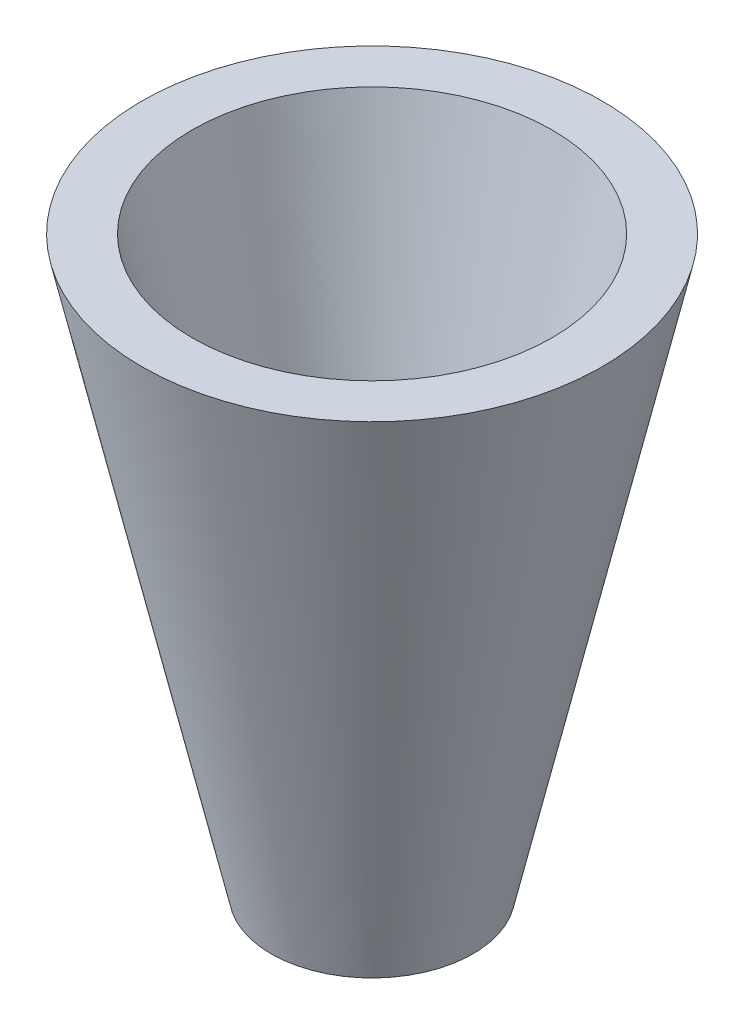
ISO-10303-21;
HEADER;
FILE_DESCRIPTION(('STEP AP214'),'2;1');
FILE_NAME('part.step','',(''),(''),'','','');
FILE_SCHEMA(('AUTOMOTIVE_DESIGN { 1 0 10303 214 1 1 1 1 }'));
ENDSEC;
DATA;
#1=APPLICATION_CONTEXT('core data for automotive mechanical design processes');
#2=APPLICATION_PROTOCOL_DEFINITION('international standard','automotive_design',2000,#1);
#3=PRODUCT_CONTEXT('',#1,'mechanical');
#4=PRODUCT('Part','Part','',(#3));
#5=PRODUCT_RELATED_PRODUCT_CATEGORY('part','',(#4));
#6=PRODUCT_DEFINITION_FORMATION('','',#4);
#7=PRODUCT_DEFINITION_CONTEXT('part definition',#1,'design');
#8=PRODUCT_DEFINITION('design','',#6,#7);
#9=PRODUCT_DEFINITION_SHAPE('','',#8);
#10=(LENGTH_UNIT() NAMED_UNIT(*) SI_UNIT(.MILLI.,.METRE.));
#11=(NAMED_UNIT(*) PLANE_ANGLE_UNIT() SI_UNIT($,.RADIAN.));
#12=(NAMED_UNIT(*) SI_UNIT($,.STERADIAN.) SOLID_ANGLE_UNIT());
#13=UNCERTAINTY_MEASURE_WITH_UNIT(LENGTH_MEASURE(1.E-05),#10,'distance_accuracy_value','');
#14=(GEOMETRIC_REPRESENTATION_CONTEXT(3) GLOBAL_UNCERTAINTY_ASSIGNED_CONTEXT((#13)) GLOBAL_UNIT_ASSIGNED_CONTEXT((#10,
#11,#12)) REPRESENTATION_CONTEXT('',''));
#15=CARTESIAN_POINT('',(0.,0.,0.));
#16=DIRECTION('',(0.,0.,1.));
#17=DIRECTION('',(1.,0.,0.));
#18=AXIS2_PLACEMENT_3D('',#15,#16,#17);
#19=CARTESIAN_POINT('',(47.0636635439506,55.4678891767989,0.));
#20=DIRECTION('',(0.,-1.,0.));
#21=DIRECTION('',(0.,0.,-1.));
#22=AXIS2_PLACEMENT_3D('',#19,#20,#21);
#23=PLANE('',#22);
#24=CARTESIAN_POINT('',(0.,55.4678891767989,0.));
#25=DIRECTION('',(0.,-1.,0.));
#26=DIRECTION('',(0.,0.,-1.));
#27=AXIS2_PLACEMENT_3D('',#24,#25,#26);
#28=CIRCLE('',#27,36.8127631240113);
#29=CARTESIAN_POINT('',(0.,55.4678891767989,36.8127631240113));
#30=VERTEX_POINT('',#29);
#31=EDGE_CURVE('E45',#30,#30,#28,.F.);
#32=ORIENTED_EDGE('',*,*,#31,.F.);
#33=EDGE_LOOP('',(#32));
#34=FACE_BOUND('',#33,.T.);
#35=CARTESIAN_POINT('',(0.,55.4678891767989,0.));
#36=DIRECTION('',(0.,1.,0.));
#37=DIRECTION('',(0.,0.,1.));
#38=AXIS2_PLACEMENT_3D('',#35,#36,#37);
#39=CIRCLE('',#38,47.0636635439506);
#40=CARTESIAN_POINT('',(0.,55.4678891767989,47.0636635439506));
#41=VERTEX_POINT('',#40);
#42=EDGE_CURVE('E37',#41,#41,#39,.T.);
#43=ORIENTED_EDGE('',*,*,#42,.T.);
#44=EDGE_LOOP('',(#43));
#45=FACE_BOUND('',#44,.T.);
#46=ADVANCED_FACE('F31',(#34,#45),#23,.F.);
#47=CARTESIAN_POINT('',(0.,-61.7110282183433,0.));
#48=DIRECTION('',(0.,1.,0.));
#49=DIRECTION('',(0.,0.,1.));
#50=AXIS2_PLACEMENT_3D('',#47,#48,#49);
#51=PLANE('',#50);
#52=CARTESIAN_POINT('',(0.,-61.7110282183433,0.));
#53=DIRECTION('',(0.,1.,0.));
#54=DIRECTION('',(0.,0.,1.));
#55=AXIS2_PLACEMENT_3D('',#52,#53,#54);
#56=CIRCLE('',#55,10.3994825636309);
#57=CARTESIAN_POINT('',(0.,-61.7110282183433,10.3994825636309));
#58=VERTEX_POINT('',#57);
#59=EDGE_CURVE('E41',#58,#58,#56,.T.);
#60=ORIENTED_EDGE('',*,*,#59,.T.);
#61=EDGE_LOOP('',(#60));
#62=FACE_BOUND('',#61,.T.);
#63=CARTESIAN_POINT('',(0.,-61.7110282183433,0.));
#64=DIRECTION('',(0.,1.,0.));
#65=DIRECTION('',(0.,0.,1.));
#66=AXIS2_PLACEMENT_3D('',#63,#64,#65);
#67=CIRCLE('',#66,20.6503829835701);
#68=CARTESIAN_POINT('',(0.,-61.7110282183433,20.6503829835701));
#69=VERTEX_POINT('',#68);
#70=EDGE_CURVE('E10',#69,#69,#67,.T.);
#71=ORIENTED_EDGE('',*,*,#70,.F.);
#72=EDGE_LOOP('',(#71));
#73=FACE_BOUND('',#72,.T.);
#74=ADVANCED_FACE('F55',(#62,#73),#51,.F.);
#75=CARTESIAN_POINT('',(0.,-61.7110282183433,0.));
#76=DIRECTION('',(0.,1.,0.));
#77=DIRECTION('',(0.,0.,1.));
#78=AXIS2_PLACEMENT_3D('',#75,#76,#77);
#79=CONICAL_SURFACE('',#78,20.6503829835701,0.221704495960385);
#80=ORIENTED_EDGE('',*,*,#42,.F.);
#81=EDGE_LOOP('',(#80));
#82=FACE_BOUND('',#81,.T.);
#83=ORIENTED_EDGE('',*,*,#70,.T.);
#84=EDGE_LOOP('',(#83));
#85=FACE_BOUND('',#84,.T.);
#86=ADVANCED_FACE('F59',(#82,#85),#79,.T.);
#87=CARTESIAN_POINT('',(0.,-59.5121010331068,0.));
#88=DIRECTION('',(0.,1.,0.));
#89=DIRECTION('',(0.,0.,1.));
#90=AXIS2_PLACEMENT_3D('',#87,#88,#89);
#91=CONICAL_SURFACE('',#90,10.8951423799752,0.221704495960385);
#92=CARTESIAN_POINT('',(0.,55.4678891767989,36.8127631240113));
#93=CARTESIAN_POINT('',(0.,54.2472754539328,36.5376247848407));
#94=CARTESIAN_POINT('',(0.,53.0266617310668,36.2624864456701));
#95=CARTESIAN_POINT('',(0.,50.5854342853346,35.7122097673288));
#96=CARTESIAN_POINT('',(0.,49.3648205624686,35.4370714281582));
#97=CARTESIAN_POINT('',(0.,46.9235931167364,34.8867947498169));
#98=CARTESIAN_POINT('',(0.,45.7029793938704,34.6116564106463));
#99=CARTESIAN_POINT('',(0.,43.2617519481382,34.061379732305));
#100=CARTESIAN_POINT('',(0.,42.0411382252722,33.7862413931344));
#101=CARTESIAN_POINT('',(0.,39.5999107795401,33.2359647147931));
#102=CARTESIAN_POINT('',(0.,38.379297056674,32.9608263756225));
#103=CARTESIAN_POINT('',(0.,35.9380696109419,32.4105496972812));
#104=CARTESIAN_POINT('',(0.,34.7174558880758,32.1354113581106));
#105=CARTESIAN_POINT('',(0.,32.2762284423437,31.5851346797694));
#106=CARTESIAN_POINT('',(0.,31.0556147194776,31.3099963405987));
#107=CARTESIAN_POINT('',(0.,28.6143872737455,30.7597196622575));
#108=CARTESIAN_POINT('',(0.,27.3937735508794,30.4845813230869));
#109=CARTESIAN_POINT('',(0.,24.9525461051473,29.9343046447456));
#110=CARTESIAN_POINT('',(0.,23.7319323822812,29.6591663055749));
#111=CARTESIAN_POINT('',(0.,21.2907049365491,29.1088896272337));
#112=CARTESIAN_POINT('',(0.,20.070091213683,28.8337512880631));
#113=CARTESIAN_POINT('',(0.,17.6288637679509,28.2834746097218));
#114=CARTESIAN_POINT('',(0.,16.4082500450848,28.0083362705512));
#115=CARTESIAN_POINT('',(0.,13.9670225993527,27.4580595922099));
#116=CARTESIAN_POINT('',(0.,12.7464088764866,27.1829212530393));
#117=CARTESIAN_POINT('',(0.,10.3051814307545,26.632644574698));
#118=CARTESIAN_POINT('',(0.,9.08456770788843,26.3575062355274));
#119=CARTESIAN_POINT('',(0.,6.6433402621563,25.8072295571861));
#120=CARTESIAN_POINT('',(0.,5.42272653929024,25.5320912180155));
#121=CARTESIAN_POINT('',(0.,2.98149909355811,24.9818145396742));
#122=CARTESIAN_POINT('',(0.,1.76088537069204,24.7066762005036));
#123=CARTESIAN_POINT('',(0.,-0.68034207504009,24.1563995221624));
#124=CARTESIAN_POINT('',(0.,-1.90095579790616,23.8812611829917));
#125=CARTESIAN_POINT('',(0.,-4.34218324363829,23.3309845046505));
#126=CARTESIAN_POINT('',(0.,-5.56279696650435,23.0558461654798));
#127=CARTESIAN_POINT('',(0.,-8.00402441223648,22.5055694871386));
#128=CARTESIAN_POINT('',(0.,-9.22463813510255,22.230431147968));
#129=CARTESIAN_POINT('',(0.,-11.6658655808347,21.6801544696267));
#130=CARTESIAN_POINT('',(0.,-12.8864793037007,21.4050161304561));
#131=CARTESIAN_POINT('',(0.,-15.3277067494329,20.8547394521148));
#132=CARTESIAN_POINT('',(0.,-16.5483204722989,20.5796011129442));
#133=CARTESIAN_POINT('',(0.,-18.9895479180311,20.0293244346029));
#134=CARTESIAN_POINT('',(0.,-20.2101616408971,19.7541860954323));
#135=CARTESIAN_POINT('',(0.,-22.6513890866293,19.203909417091));
#136=CARTESIAN_POINT('',(0.,-23.8720028094953,18.9287710779204));
#137=CARTESIAN_POINT('',(0.,-26.3132302552275,18.3784943995791));
#138=CARTESIAN_POINT('',(0.,-27.5338439780935,18.1033560604085));
#139=CARTESIAN_POINT('',(0.,-29.9750714238257,17.5530793820672));
#140=CARTESIAN_POINT('',(0.,-31.1956851466917,17.2779410428966));
#141=CARTESIAN_POINT('',(0.,-33.6369125924238,16.7276643645554));
#142=CARTESIAN_POINT('',(0.,-34.8575263152899,16.4525260253847));
#143=CARTESIAN_POINT('',(0.,-37.298753761022,15.9022493470435));
#144=CARTESIAN_POINT('',(0.,-38.5193674838881,15.6271110078728));
#145=CARTESIAN_POINT('',(0.,-40.9605949296202,15.0768343295316));
#146=CARTESIAN_POINT('',(0.,-42.1812086524863,14.801695990361));
#147=CARTESIAN_POINT('',(0.,-44.6224360982184,14.2514193120197));
#148=CARTESIAN_POINT('',(0.,-45.8430498210845,13.9762809728491));
#149=CARTESIAN_POINT('',(0.,-48.2842772668166,13.4260042945078));
#150=CARTESIAN_POINT('',(0.,-49.5048909896827,13.1508659553372));
#151=CARTESIAN_POINT('',(0.,-51.9461184354148,12.6005892769959));
#152=CARTESIAN_POINT('',(0.,-53.1667321582809,12.3254509378253));
#153=CARTESIAN_POINT('',(0.,-55.607959604013,11.775174259484));
#154=CARTESIAN_POINT('',(0.,-56.8285733268791,11.5000359203134));
#155=CARTESIAN_POINT('',(0.,-59.2698007726112,10.9497592419721));
#156=CARTESIAN_POINT('',(0.,-60.4904144954773,10.6746209028015));
#157=CARTESIAN_POINT('',(0.,-61.7110282183433,10.3994825636309));
#158=B_SPLINE_CURVE_WITH_KNOTS('',3,(#92,#93,#94,#95,#96,#97,#98,#99,#100,#101,#102,#103,#104,
#105,#106,#107,#108,#109,#110,#111,#112,#113,#114,#115,#116,#117,#118,#119,#120,#121,#122,#123,
#124,#125,#126,#127,#128,#129,#130,#131,#132,#133,#134,#135,#136,#137,#138,#139,#140,#141,#142,
#143,#144,#145,#146,#147,#148,#149,#150,#151,#152,#153,#154,#155,#156,#157),.UNSPECIFIED.,.F.,
.F.,(4,2,2,2,2,2,2,2,2,2,2,2,2,2,2,2,2,2,2,2,2,2,2,2,2,2,2,2,2,2,2,2,4),(0.,3.75371691729341,
7.50743383458683,11.2611507518802,15.0148676691737,18.7685845864671,22.5223015037605,
26.2760184210539,30.0297353383473,33.7834522556407,37.5371691729341,41.2908860902275,
45.0446030075209,48.7983199248143,52.5520368421077,56.3057537594012,60.0594706766946,
63.813187593988,67.5669045112814,71.3206214285748,75.0743383458682,78.8280552631616,
82.581772180455,86.3354890977485,90.0892060150419,93.8429229323353,97.5966398496287,
101.350356766922,105.104073684216,108.857790601509,112.611507518802,116.365224436096,
120.118941353389),.UNSPECIFIED.);
#159=EDGE_CURVE('BSEAM51',#30,#58,#158,.T.);
#160=ORIENTED_EDGE('',*,*,#31,.T.);
#161=ORIENTED_EDGE('',*,*,#59,.F.);
#162=ORIENTED_EDGE('',*,*,#159,.T.);
#163=ORIENTED_EDGE('',*,*,#159,.F.);
#164=EDGE_LOOP('',(#160,#162,#161,#163));
#165=FACE_BOUND('',#164,.T.);
#166=ADVANCED_FACE('F51',(#165),#91,.F.);
#167=CLOSED_SHELL('',(#46,#74,#86,#166));
#168=MANIFOLD_SOLID_BREP('B2',#167);
#169=ADVANCED_BREP_SHAPE_REPRESENTATION('',(#18,#168),#14);
#170=SHAPE_DEFINITION_REPRESENTATION(#9,#169);
ENDSEC;
END-ISO-10303-21;
